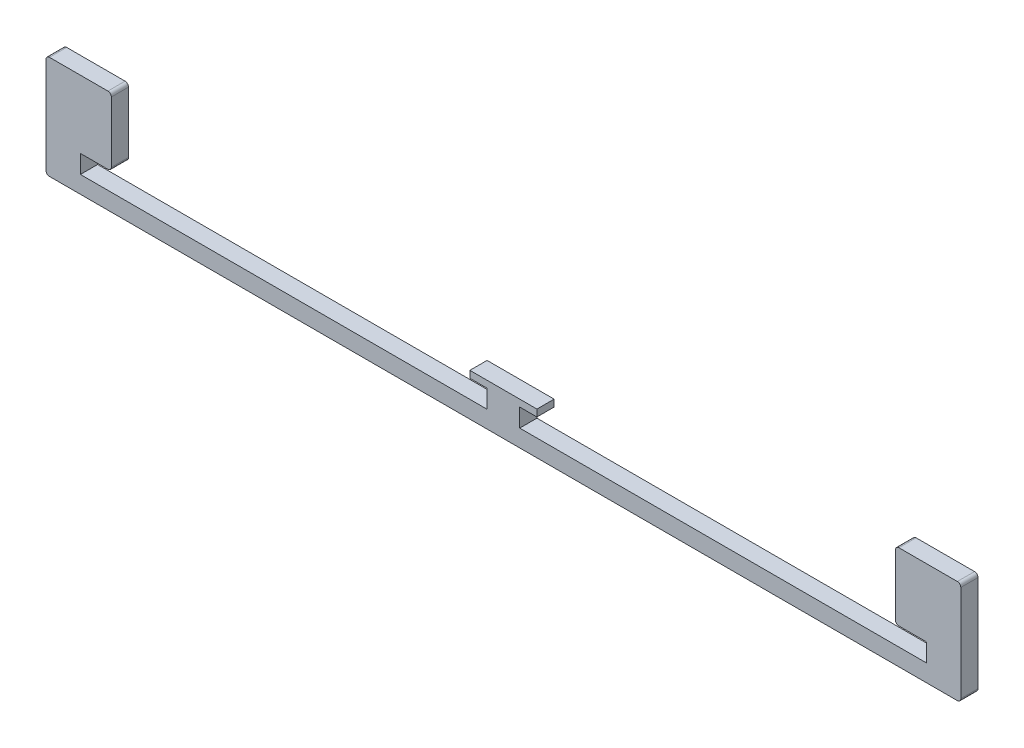
ISO-10303-21;
HEADER;
FILE_DESCRIPTION(('STEP AP214'),'2;1');
FILE_NAME('part.step','',(''),(''),'','','');
FILE_SCHEMA(('AUTOMOTIVE_DESIGN { 1 0 10303 214 1 1 1 1 }'));
ENDSEC;
DATA;
#1=APPLICATION_CONTEXT('core data for automotive mechanical design processes');
#2=APPLICATION_PROTOCOL_DEFINITION('international standard','automotive_design',2000,#1);
#3=PRODUCT_CONTEXT('',#1,'mechanical');
#4=PRODUCT('Part','Part','',(#3));
#5=PRODUCT_RELATED_PRODUCT_CATEGORY('part','',(#4));
#6=PRODUCT_DEFINITION_FORMATION('','',#4);
#7=PRODUCT_DEFINITION_CONTEXT('part definition',#1,'design');
#8=PRODUCT_DEFINITION('design','',#6,#7);
#9=PRODUCT_DEFINITION_SHAPE('','',#8);
#10=(LENGTH_UNIT() NAMED_UNIT(*) SI_UNIT(.MILLI.,.METRE.));
#11=(NAMED_UNIT(*) PLANE_ANGLE_UNIT() SI_UNIT($,.RADIAN.));
#12=(NAMED_UNIT(*) SI_UNIT($,.STERADIAN.) SOLID_ANGLE_UNIT());
#13=UNCERTAINTY_MEASURE_WITH_UNIT(LENGTH_MEASURE(1.E-05),#10,'distance_accuracy_value','');
#14=(GEOMETRIC_REPRESENTATION_CONTEXT(3) GLOBAL_UNCERTAINTY_ASSIGNED_CONTEXT((#13)) GLOBAL_UNIT_ASSIGNED_CONTEXT((#10,
#11,#12)) REPRESENTATION_CONTEXT('',''));
#15=CARTESIAN_POINT('',(0.,0.,0.));
#16=DIRECTION('',(0.,0.,1.));
#17=DIRECTION('',(1.,0.,0.));
#18=AXIS2_PLACEMENT_3D('',#15,#16,#17);
#19=CARTESIAN_POINT('',(0.,30.,5.));
#20=DIRECTION('',(1.,0.,0.));
#21=DIRECTION('',(0.,0.,-1.));
#22=AXIS2_PLACEMENT_3D('',#19,#20,#21);
#23=PLANE('',#22);
#24=DIRECTION('',(0.,-1.,0.));
#25=VECTOR('',#24,1.);
#26=CARTESIAN_POINT('',(0.,30.,0.));
#27=LINE('',#26,#25);
#28=CARTESIAN_POINT('',(0.,29.,0.));
#29=VERTEX_POINT('',#28);
#30=CARTESIAN_POINT('',(0.,1.,0.));
#31=VERTEX_POINT('',#30);
#32=EDGE_CURVE('E249',#29,#31,#27,.T.);
#33=ORIENTED_EDGE('',*,*,#32,.T.);
#34=DIRECTION('',(0.,0.,-1.));
#35=VECTOR('',#34,1.);
#36=CARTESIAN_POINT('',(0.,1.,5.));
#37=LINE('',#36,#35);
#38=CARTESIAN_POINT('',(0.,1.,5.));
#39=VERTEX_POINT('',#38);
#40=EDGE_CURVE('E374',#31,#39,#37,.F.);
#41=ORIENTED_EDGE('',*,*,#40,.T.);
#42=DIRECTION('',(0.,-1.,0.));
#43=VECTOR('',#42,1.);
#44=CARTESIAN_POINT('',(0.,30.,5.));
#45=LINE('',#44,#43);
#46=CARTESIAN_POINT('',(0.,29.,5.));
#47=VERTEX_POINT('',#46);
#48=EDGE_CURVE('E259',#47,#39,#45,.T.);
#49=ORIENTED_EDGE('',*,*,#48,.F.);
#50=DIRECTION('',(0.,0.,-1.));
#51=VECTOR('',#50,1.);
#52=CARTESIAN_POINT('',(0.,29.,5.));
#53=LINE('',#52,#51);
#54=EDGE_CURVE('E371',#47,#29,#53,.T.);
#55=ORIENTED_EDGE('',*,*,#54,.T.);
#56=EDGE_LOOP('',(#33,#41,#49,#55));
#57=FACE_BOUND('',#56,.T.);
#58=ADVANCED_FACE('F37',(#57),#23,.F.);
#59=CARTESIAN_POINT('',(0.,0.,5.));
#60=DIRECTION('',(0.,1.,0.));
#61=DIRECTION('',(0.,0.,1.));
#62=AXIS2_PLACEMENT_3D('',#59,#60,#61);
#63=PLANE('',#62);
#64=DIRECTION('',(1.,0.,0.));
#65=VECTOR('',#64,1.);
#66=CARTESIAN_POINT('',(0.,0.,0.));
#67=LINE('',#66,#65);
#68=CARTESIAN_POINT('',(1.,0.,0.));
#69=VERTEX_POINT('',#68);
#70=CARTESIAN_POINT('',(265.,0.,0.));
#71=VERTEX_POINT('',#70);
#72=EDGE_CURVE('E253',#69,#71,#67,.T.);
#73=ORIENTED_EDGE('',*,*,#72,.T.);
#74=DIRECTION('',(0.,0.,-1.));
#75=VECTOR('',#74,1.);
#76=CARTESIAN_POINT('',(265.,0.,5.));
#77=LINE('',#76,#75);
#78=CARTESIAN_POINT('',(265.,0.,5.));
#79=VERTEX_POINT('',#78);
#80=EDGE_CURVE('E341',#71,#79,#77,.F.);
#81=ORIENTED_EDGE('',*,*,#80,.T.);
#82=DIRECTION('',(1.,0.,0.));
#83=VECTOR('',#82,1.);
#84=CARTESIAN_POINT('',(0.,0.,5.));
#85=LINE('',#84,#83);
#86=CARTESIAN_POINT('',(1.,0.,5.));
#87=VERTEX_POINT('',#86);
#88=EDGE_CURVE('E232',#87,#79,#85,.T.);
#89=ORIENTED_EDGE('',*,*,#88,.F.);
#90=DIRECTION('',(0.,0.,-1.));
#91=VECTOR('',#90,1.);
#92=CARTESIAN_POINT('',(1.,0.,5.));
#93=LINE('',#92,#91);
#94=EDGE_CURVE('E338',#87,#69,#93,.T.);
#95=ORIENTED_EDGE('',*,*,#94,.T.);
#96=EDGE_LOOP('',(#73,#81,#89,#95));
#97=FACE_BOUND('',#96,.T.);
#98=ADVANCED_FACE('F412',(#97),#63,.F.);
#99=CARTESIAN_POINT('',(123.25,12.3,5.));
#100=DIRECTION('',(0.,-1.,0.));
#101=DIRECTION('',(0.,0.,-1.));
#102=AXIS2_PLACEMENT_3D('',#99,#100,#101);
#103=PLANE('',#102);
#104=DIRECTION('',(-1.,0.,0.));
#105=VECTOR('',#104,1.);
#106=CARTESIAN_POINT('',(123.25,12.3,0.));
#107=LINE('',#106,#105);
#108=CARTESIAN_POINT('',(142.75,12.3,0.));
#109=VERTEX_POINT('',#108);
#110=CARTESIAN_POINT('',(123.25,12.3,0.));
#111=VERTEX_POINT('',#110);
#112=EDGE_CURVE('E283',#109,#111,#107,.T.);
#113=ORIENTED_EDGE('',*,*,#112,.T.);
#114=DIRECTION('',(0.,0.,-1.));
#115=VECTOR('',#114,1.);
#116=CARTESIAN_POINT('',(123.25,12.3,5.));
#117=LINE('',#116,#115);
#118=CARTESIAN_POINT('',(123.25,12.3,5.));
#119=VERTEX_POINT('',#118);
#120=EDGE_CURVE('E229',#119,#111,#117,.T.);
#121=ORIENTED_EDGE('',*,*,#120,.F.);
#122=DIRECTION('',(-1.,0.,0.));
#123=VECTOR('',#122,1.);
#124=CARTESIAN_POINT('',(123.25,12.3,5.));
#125=LINE('',#124,#123);
#126=CARTESIAN_POINT('',(142.75,12.3,5.));
#127=VERTEX_POINT('',#126);
#128=EDGE_CURVE('E223',#127,#119,#125,.T.);
#129=ORIENTED_EDGE('',*,*,#128,.F.);
#130=DIRECTION('',(0.,0.,-1.));
#131=VECTOR('',#130,1.);
#132=CARTESIAN_POINT('',(142.75,12.3,5.));
#133=LINE('',#132,#131);
#134=EDGE_CURVE('E227',#127,#109,#133,.T.);
#135=ORIENTED_EDGE('',*,*,#134,.T.);
#136=EDGE_LOOP('',(#113,#121,#129,#135));
#137=FACE_BOUND('',#136,.T.);
#138=ADVANCED_FACE('F225',(#137),#103,.F.);
#139=CARTESIAN_POINT('',(123.25,10.3,5.));
#140=DIRECTION('',(1.,0.,0.));
#141=DIRECTION('',(0.,0.,-1.));
#142=AXIS2_PLACEMENT_3D('',#139,#140,#141);
#143=PLANE('',#142);
#144=DIRECTION('',(0.,-1.,0.));
#145=VECTOR('',#144,1.);
#146=CARTESIAN_POINT('',(123.25,10.3,0.));
#147=LINE('',#146,#145);
#148=CARTESIAN_POINT('',(123.25,10.3,0.));
#149=VERTEX_POINT('',#148);
#150=EDGE_CURVE('E285',#111,#149,#147,.T.);
#151=ORIENTED_EDGE('',*,*,#150,.T.);
#152=DIRECTION('',(0.,0.,-1.));
#153=VECTOR('',#152,1.);
#154=CARTESIAN_POINT('',(123.25,10.3,5.));
#155=LINE('',#154,#153);
#156=CARTESIAN_POINT('',(123.25,10.3,5.));
#157=VERTEX_POINT('',#156);
#158=EDGE_CURVE('E313',#157,#149,#155,.T.);
#159=ORIENTED_EDGE('',*,*,#158,.F.);
#160=DIRECTION('',(0.,-1.,0.));
#161=VECTOR('',#160,1.);
#162=CARTESIAN_POINT('',(123.25,10.3,5.));
#163=LINE('',#162,#161);
#164=EDGE_CURVE('E231',#119,#157,#163,.T.);
#165=ORIENTED_EDGE('',*,*,#164,.F.);
#166=ORIENTED_EDGE('',*,*,#120,.T.);
#167=EDGE_LOOP('',(#151,#159,#165,#166));
#168=FACE_BOUND('',#167,.T.);
#169=ADVANCED_FACE('F486',(#168),#143,.F.);
#170=CARTESIAN_POINT('',(123.25,10.3,5.));
#171=DIRECTION('',(0.,1.,0.));
#172=DIRECTION('',(0.,0.,1.));
#173=AXIS2_PLACEMENT_3D('',#170,#171,#172);
#174=PLANE('',#173);
#175=DIRECTION('',(1.,0.,0.));
#176=VECTOR('',#175,1.);
#177=CARTESIAN_POINT('',(123.25,10.3,0.));
#178=LINE('',#177,#176);
#179=CARTESIAN_POINT('',(128.25,10.3,0.));
#180=VERTEX_POINT('',#179);
#181=EDGE_CURVE('E287',#149,#180,#178,.T.);
#182=ORIENTED_EDGE('',*,*,#181,.T.);
#183=DIRECTION('',(0.,0.,-1.));
#184=VECTOR('',#183,1.);
#185=CARTESIAN_POINT('',(128.25,10.3,5.));
#186=LINE('',#185,#184);
#187=CARTESIAN_POINT('',(128.25,10.3,5.));
#188=VERTEX_POINT('',#187);
#189=EDGE_CURVE('E310',#188,#180,#186,.T.);
#190=ORIENTED_EDGE('',*,*,#189,.F.);
#191=DIRECTION('',(1.,0.,0.));
#192=VECTOR('',#191,1.);
#193=CARTESIAN_POINT('',(123.25,10.3,5.));
#194=LINE('',#193,#192);
#195=EDGE_CURVE('E265',#157,#188,#194,.T.);
#196=ORIENTED_EDGE('',*,*,#195,.F.);
#197=ORIENTED_EDGE('',*,*,#158,.T.);
#198=EDGE_LOOP('',(#182,#190,#196,#197));
#199=FACE_BOUND('',#198,.T.);
#200=ADVANCED_FACE('F493',(#199),#174,.F.);
#201=CARTESIAN_POINT('',(128.25,5.,5.));
#202=DIRECTION('',(1.,0.,0.));
#203=DIRECTION('',(0.,1.,0.));
#204=AXIS2_PLACEMENT_3D('',#201,#202,#203);
#205=PLANE('',#204);
#206=DIRECTION('',(0.,-1.,0.));
#207=VECTOR('',#206,1.);
#208=CARTESIAN_POINT('',(128.25,5.,0.));
#209=LINE('',#208,#207);
#210=CARTESIAN_POINT('',(128.25,5.,0.));
#211=VERTEX_POINT('',#210);
#212=EDGE_CURVE('E289',#180,#211,#209,.T.);
#213=ORIENTED_EDGE('',*,*,#212,.T.);
#214=DIRECTION('',(0.,0.,-1.));
#215=VECTOR('',#214,1.);
#216=CARTESIAN_POINT('',(128.25,5.,5.));
#217=LINE('',#216,#215);
#218=CARTESIAN_POINT('',(128.25,5.,5.));
#219=VERTEX_POINT('',#218);
#220=EDGE_CURVE('E307',#219,#211,#217,.T.);
#221=ORIENTED_EDGE('',*,*,#220,.F.);
#222=DIRECTION('',(0.,-1.,0.));
#223=VECTOR('',#222,1.);
#224=CARTESIAN_POINT('',(128.25,5.,5.));
#225=LINE('',#224,#223);
#226=EDGE_CURVE('E267',#188,#219,#225,.T.);
#227=ORIENTED_EDGE('',*,*,#226,.F.);
#228=ORIENTED_EDGE('',*,*,#189,.T.);
#229=EDGE_LOOP('',(#213,#221,#227,#228));
#230=FACE_BOUND('',#229,.T.);
#231=ADVANCED_FACE('F496',(#230),#205,.F.);
#232=CARTESIAN_POINT('',(10.,5.,5.));
#233=DIRECTION('',(0.,-1.,0.));
#234=DIRECTION('',(0.,0.,-1.));
#235=AXIS2_PLACEMENT_3D('',#232,#233,#234);
#236=PLANE('',#235);
#237=DIRECTION('',(-1.,0.,0.));
#238=VECTOR('',#237,1.);
#239=CARTESIAN_POINT('',(10.,5.,0.));
#240=LINE('',#239,#238);
#241=CARTESIAN_POINT('',(10.,5.,0.));
#242=VERTEX_POINT('',#241);
#243=EDGE_CURVE('E291',#211,#242,#240,.T.);
#244=ORIENTED_EDGE('',*,*,#243,.T.);
#245=DIRECTION('',(0.,0.,-1.));
#246=VECTOR('',#245,1.);
#247=CARTESIAN_POINT('',(10.,5.,5.));
#248=LINE('',#247,#246);
#249=CARTESIAN_POINT('',(10.,5.,5.));
#250=VERTEX_POINT('',#249);
#251=EDGE_CURVE('E304',#250,#242,#248,.T.);
#252=ORIENTED_EDGE('',*,*,#251,.F.);
#253=DIRECTION('',(-1.,0.,0.));
#254=VECTOR('',#253,1.);
#255=CARTESIAN_POINT('',(10.,5.,5.));
#256=LINE('',#255,#254);
#257=EDGE_CURVE('E269',#219,#250,#256,.T.);
#258=ORIENTED_EDGE('',*,*,#257,.F.);
#259=ORIENTED_EDGE('',*,*,#220,.T.);
#260=EDGE_LOOP('',(#244,#252,#258,#259));
#261=FACE_BOUND('',#260,.T.);
#262=ADVANCED_FACE('F501',(#261),#236,.F.);
#263=CARTESIAN_POINT('',(10.,5.,5.));
#264=DIRECTION('',(-1.,0.,0.));
#265=DIRECTION('',(0.,-1.,0.));
#266=AXIS2_PLACEMENT_3D('',#263,#264,#265);
#267=PLANE('',#266);
#268=DIRECTION('',(0.,1.,0.));
#269=VECTOR('',#268,1.);
#270=CARTESIAN_POINT('',(10.,5.,0.));
#271=LINE('',#270,#269);
#272=CARTESIAN_POINT('',(10.,10.3,0.));
#273=VERTEX_POINT('',#272);
#274=EDGE_CURVE('E293',#242,#273,#271,.T.);
#275=ORIENTED_EDGE('',*,*,#274,.T.);
#276=DIRECTION('',(0.,0.,-1.));
#277=VECTOR('',#276,1.);
#278=CARTESIAN_POINT('',(10.,10.3,5.));
#279=LINE('',#278,#277);
#280=CARTESIAN_POINT('',(10.,10.3,5.));
#281=VERTEX_POINT('',#280);
#282=EDGE_CURVE('E279',#281,#273,#279,.T.);
#283=ORIENTED_EDGE('',*,*,#282,.F.);
#284=DIRECTION('',(0.,1.,0.));
#285=VECTOR('',#284,1.);
#286=CARTESIAN_POINT('',(10.,5.,5.));
#287=LINE('',#286,#285);
#288=EDGE_CURVE('E271',#250,#281,#287,.T.);
#289=ORIENTED_EDGE('',*,*,#288,.F.);
#290=ORIENTED_EDGE('',*,*,#251,.T.);
#291=EDGE_LOOP('',(#275,#283,#289,#290));
#292=FACE_BOUND('',#291,.T.);
#293=ADVANCED_FACE('F506',(#292),#267,.F.);
#294=CARTESIAN_POINT('',(10.,10.3,5.));
#295=DIRECTION('',(0.,1.,0.));
#296=DIRECTION('',(0.,0.,1.));
#297=AXIS2_PLACEMENT_3D('',#294,#295,#296);
#298=PLANE('',#297);
#299=DIRECTION('',(1.,0.,0.));
#300=VECTOR('',#299,1.);
#301=CARTESIAN_POINT('',(10.,10.3,0.));
#302=LINE('',#301,#300);
#303=CARTESIAN_POINT('',(18.,10.3,0.));
#304=VERTEX_POINT('',#303);
#305=EDGE_CURVE('E295',#273,#304,#302,.T.);
#306=ORIENTED_EDGE('',*,*,#305,.T.);
#307=DIRECTION('',(0.,0.,-1.));
#308=VECTOR('',#307,1.);
#309=CARTESIAN_POINT('',(18.,10.3,5.));
#310=LINE('',#309,#308);
#311=CARTESIAN_POINT('',(18.,10.3,5.));
#312=VERTEX_POINT('',#311);
#313=EDGE_CURVE('E11',#304,#312,#310,.F.);
#314=ORIENTED_EDGE('',*,*,#313,.T.);
#315=DIRECTION('',(1.,0.,0.));
#316=VECTOR('',#315,1.);
#317=CARTESIAN_POINT('',(10.,10.3,5.));
#318=LINE('',#317,#316);
#319=EDGE_CURVE('E273',#281,#312,#318,.T.);
#320=ORIENTED_EDGE('',*,*,#319,.F.);
#321=ORIENTED_EDGE('',*,*,#282,.T.);
#322=EDGE_LOOP('',(#306,#314,#320,#321));
#323=FACE_BOUND('',#322,.T.);
#324=ADVANCED_FACE('F510',(#323),#298,.F.);
#325=CARTESIAN_POINT('',(19.,10.3,5.));
#326=DIRECTION('',(-1.,0.,0.));
#327=DIRECTION('',(0.,0.,1.));
#328=AXIS2_PLACEMENT_3D('',#325,#326,#327);
#329=PLANE('',#328);
#330=DIRECTION('',(0.,1.,0.));
#331=VECTOR('',#330,1.);
#332=CARTESIAN_POINT('',(19.,10.3,0.));
#333=LINE('',#332,#331);
#334=CARTESIAN_POINT('',(19.,11.3,0.));
#335=VERTEX_POINT('',#334);
#336=CARTESIAN_POINT('',(19.,29.,0.));
#337=VERTEX_POINT('',#336);
#338=EDGE_CURVE('E298',#335,#337,#333,.T.);
#339=ORIENTED_EDGE('',*,*,#338,.T.);
#340=DIRECTION('',(0.,0.,-1.));
#341=VECTOR('',#340,1.);
#342=CARTESIAN_POINT('',(19.,29.,5.));
#343=LINE('',#342,#341);
#344=CARTESIAN_POINT('',(19.,29.,5.));
#345=VERTEX_POINT('',#344);
#346=EDGE_CURVE('E45',#337,#345,#343,.F.);
#347=ORIENTED_EDGE('',*,*,#346,.T.);
#348=DIRECTION('',(0.,1.,0.));
#349=VECTOR('',#348,1.);
#350=CARTESIAN_POINT('',(19.,10.3,5.));
#351=LINE('',#350,#349);
#352=CARTESIAN_POINT('',(19.,11.3,5.));
#353=VERTEX_POINT('',#352);
#354=EDGE_CURVE('E276',#353,#345,#351,.T.);
#355=ORIENTED_EDGE('',*,*,#354,.F.);
#356=DIRECTION('',(0.,0.,-1.));
#357=VECTOR('',#356,1.);
#358=CARTESIAN_POINT('',(19.,11.3,5.));
#359=LINE('',#358,#357);
#360=EDGE_CURVE('E380',#353,#335,#359,.T.);
#361=ORIENTED_EDGE('',*,*,#360,.T.);
#362=EDGE_LOOP('',(#339,#347,#355,#361));
#363=FACE_BOUND('',#362,.T.);
#364=ADVANCED_FACE('F385',(#363),#329,.F.);
#365=CARTESIAN_POINT('',(0.,30.,5.));
#366=DIRECTION('',(0.,-1.,0.));
#367=DIRECTION('',(0.,0.,-1.));
#368=AXIS2_PLACEMENT_3D('',#365,#366,#367);
#369=PLANE('',#368);
#370=DIRECTION('',(-1.,0.,0.));
#371=VECTOR('',#370,1.);
#372=CARTESIAN_POINT('',(0.,30.,0.));
#373=LINE('',#372,#371);
#374=CARTESIAN_POINT('',(18.,30.,0.));
#375=VERTEX_POINT('',#374);
#376=CARTESIAN_POINT('',(1.,30.,0.));
#377=VERTEX_POINT('',#376);
#378=EDGE_CURVE('E262',#375,#377,#373,.T.);
#379=ORIENTED_EDGE('',*,*,#378,.T.);
#380=DIRECTION('',(0.,0.,-1.));
#381=VECTOR('',#380,1.);
#382=CARTESIAN_POINT('',(1.,30.,5.));
#383=LINE('',#382,#381);
#384=CARTESIAN_POINT('',(1.,30.,5.));
#385=VERTEX_POINT('',#384);
#386=EDGE_CURVE('E52',#377,#385,#383,.F.);
#387=ORIENTED_EDGE('',*,*,#386,.T.);
#388=DIRECTION('',(-1.,0.,0.));
#389=VECTOR('',#388,1.);
#390=CARTESIAN_POINT('',(0.,30.,5.));
#391=LINE('',#390,#389);
#392=CARTESIAN_POINT('',(18.,30.,5.));
#393=VERTEX_POINT('',#392);
#394=EDGE_CURVE('E278',#393,#385,#391,.T.);
#395=ORIENTED_EDGE('',*,*,#394,.F.);
#396=DIRECTION('',(0.,0.,-1.));
#397=VECTOR('',#396,1.);
#398=CARTESIAN_POINT('',(18.,30.,5.));
#399=LINE('',#398,#397);
#400=EDGE_CURVE('E376',#393,#375,#399,.T.);
#401=ORIENTED_EDGE('',*,*,#400,.T.);
#402=EDGE_LOOP('',(#379,#387,#395,#401));
#403=FACE_BOUND('',#402,.T.);
#404=ADVANCED_FACE('F393',(#403),#369,.F.);
#405=CARTESIAN_POINT('',(0.,0.,5.));
#406=DIRECTION('',(0.,0.,1.));
#407=DIRECTION('',(1.,0.,0.));
#408=AXIS2_PLACEMENT_3D('',#405,#406,#407);
#409=PLANE('',#408);
#410=ORIENTED_EDGE('',*,*,#88,.T.);
#411=CARTESIAN_POINT('',(265.,1.,5.));
#412=DIRECTION('',(0.,0.,1.));
#413=DIRECTION('',(1.,0.,0.));
#414=AXIS2_PLACEMENT_3D('',#411,#412,#413);
#415=CIRCLE('',#414,1.);
#416=CARTESIAN_POINT('',(266.,1.,5.));
#417=VERTEX_POINT('',#416);
#418=EDGE_CURVE('E356',#79,#417,#415,.T.);
#419=ORIENTED_EDGE('',*,*,#418,.T.);
#420=DIRECTION('',(0.,-1.,0.));
#421=VECTOR('',#420,1.);
#422=CARTESIAN_POINT('',(266.,30.,5.));
#423=LINE('',#422,#421);
#424=CARTESIAN_POINT('',(266.,29.,5.));
#425=VERTEX_POINT('',#424);
#426=EDGE_CURVE('E243',#425,#417,#423,.T.);
#427=ORIENTED_EDGE('',*,*,#426,.F.);
#428=CARTESIAN_POINT('',(265.,29.,5.));
#429=DIRECTION('',(0.,0.,1.));
#430=DIRECTION('',(1.,0.,0.));
#431=AXIS2_PLACEMENT_3D('',#428,#429,#430);
#432=CIRCLE('',#431,1.);
#433=CARTESIAN_POINT('',(265.,30.,5.));
#434=VERTEX_POINT('',#433);
#435=EDGE_CURVE('E354',#425,#434,#432,.T.);
#436=ORIENTED_EDGE('',*,*,#435,.T.);
#437=DIRECTION('',(1.,0.,0.));
#438=VECTOR('',#437,1.);
#439=CARTESIAN_POINT('',(266.,30.,5.));
#440=LINE('',#439,#438);
#441=CARTESIAN_POINT('',(248.,30.,5.));
#442=VERTEX_POINT('',#441);
#443=EDGE_CURVE('E448',#442,#434,#440,.T.);
#444=ORIENTED_EDGE('',*,*,#443,.F.);
#445=CARTESIAN_POINT('',(248.,29.,5.));
#446=DIRECTION('',(0.,0.,1.));
#447=DIRECTION('',(1.,0.,0.));
#448=AXIS2_PLACEMENT_3D('',#445,#446,#447);
#449=CIRCLE('',#448,1.);
#450=CARTESIAN_POINT('',(247.,29.,5.));
#451=VERTEX_POINT('',#450);
#452=EDGE_CURVE('E352',#442,#451,#449,.T.);
#453=ORIENTED_EDGE('',*,*,#452,.T.);
#454=DIRECTION('',(0.,1.,0.));
#455=VECTOR('',#454,1.);
#456=CARTESIAN_POINT('',(247.,10.3,5.));
#457=LINE('',#456,#455);
#458=CARTESIAN_POINT('',(247.,11.3,5.));
#459=VERTEX_POINT('',#458);
#460=EDGE_CURVE('E445',#459,#451,#457,.T.);
#461=ORIENTED_EDGE('',*,*,#460,.F.);
#462=CARTESIAN_POINT('',(248.,11.3,5.));
#463=DIRECTION('',(0.,0.,1.));
#464=DIRECTION('',(1.,0.,0.));
#465=AXIS2_PLACEMENT_3D('',#462,#463,#464);
#466=CIRCLE('',#465,1.);
#467=CARTESIAN_POINT('',(248.,10.3,5.));
#468=VERTEX_POINT('',#467);
#469=EDGE_CURVE('E350',#459,#468,#466,.T.);
#470=ORIENTED_EDGE('',*,*,#469,.T.);
#471=DIRECTION('',(-1.,0.,0.));
#472=VECTOR('',#471,1.);
#473=CARTESIAN_POINT('',(256.,10.3,5.));
#474=LINE('',#473,#472);
#475=CARTESIAN_POINT('',(256.,10.3,5.));
#476=VERTEX_POINT('',#475);
#477=EDGE_CURVE('E442',#476,#468,#474,.T.);
#478=ORIENTED_EDGE('',*,*,#477,.F.);
#479=DIRECTION('',(0.,1.,0.));
#480=VECTOR('',#479,1.);
#481=CARTESIAN_POINT('',(256.,5.,5.));
#482=LINE('',#481,#480);
#483=CARTESIAN_POINT('',(256.,5.,5.));
#484=VERTEX_POINT('',#483);
#485=EDGE_CURVE('E439',#484,#476,#482,.T.);
#486=ORIENTED_EDGE('',*,*,#485,.F.);
#487=DIRECTION('',(1.,0.,0.));
#488=VECTOR('',#487,1.);
#489=CARTESIAN_POINT('',(256.,5.,5.));
#490=LINE('',#489,#488);
#491=CARTESIAN_POINT('',(137.75,5.,5.));
#492=VERTEX_POINT('',#491);
#493=EDGE_CURVE('E436',#492,#484,#490,.T.);
#494=ORIENTED_EDGE('',*,*,#493,.F.);
#495=DIRECTION('',(0.,-1.,0.));
#496=VECTOR('',#495,1.);
#497=CARTESIAN_POINT('',(137.75,5.,5.));
#498=LINE('',#497,#496);
#499=CARTESIAN_POINT('',(137.75,10.3,5.));
#500=VERTEX_POINT('',#499);
#501=EDGE_CURVE('E433',#500,#492,#498,.T.);
#502=ORIENTED_EDGE('',*,*,#501,.F.);
#503=DIRECTION('',(-1.,0.,0.));
#504=VECTOR('',#503,1.);
#505=CARTESIAN_POINT('',(142.75,10.3,5.));
#506=LINE('',#505,#504);
#507=CARTESIAN_POINT('',(142.75,10.3,5.));
#508=VERTEX_POINT('',#507);
#509=EDGE_CURVE('E239',#508,#500,#506,.T.);
#510=ORIENTED_EDGE('',*,*,#509,.F.);
#511=DIRECTION('',(0.,-1.,0.));
#512=VECTOR('',#511,1.);
#513=CARTESIAN_POINT('',(142.75,10.3,5.));
#514=LINE('',#513,#512);
#515=EDGE_CURVE('E235',#127,#508,#514,.T.);
#516=ORIENTED_EDGE('',*,*,#515,.F.);
#517=ORIENTED_EDGE('',*,*,#128,.T.);
#518=ORIENTED_EDGE('',*,*,#164,.T.);
#519=ORIENTED_EDGE('',*,*,#195,.T.);
#520=ORIENTED_EDGE('',*,*,#226,.T.);
#521=ORIENTED_EDGE('',*,*,#257,.T.);
#522=ORIENTED_EDGE('',*,*,#288,.T.);
#523=ORIENTED_EDGE('',*,*,#319,.T.);
#524=CARTESIAN_POINT('',(18.,11.3,5.));
#525=DIRECTION('',(0.,0.,1.));
#526=DIRECTION('',(1.,0.,0.));
#527=AXIS2_PLACEMENT_3D('',#524,#525,#526);
#528=CIRCLE('',#527,1.);
#529=EDGE_CURVE('E343',#312,#353,#528,.T.);
#530=ORIENTED_EDGE('',*,*,#529,.T.);
#531=ORIENTED_EDGE('',*,*,#354,.T.);
#532=CARTESIAN_POINT('',(18.,29.,5.));
#533=DIRECTION('',(0.,0.,1.));
#534=DIRECTION('',(1.,0.,0.));
#535=AXIS2_PLACEMENT_3D('',#532,#533,#534);
#536=CIRCLE('',#535,1.);
#537=EDGE_CURVE('E59',#345,#393,#536,.T.);
#538=ORIENTED_EDGE('',*,*,#537,.T.);
#539=ORIENTED_EDGE('',*,*,#394,.T.);
#540=CARTESIAN_POINT('',(1.,29.,5.));
#541=DIRECTION('',(0.,0.,1.));
#542=DIRECTION('',(1.,0.,0.));
#543=AXIS2_PLACEMENT_3D('',#540,#541,#542);
#544=CIRCLE('',#543,1.);
#545=EDGE_CURVE('E346',#385,#47,#544,.T.);
#546=ORIENTED_EDGE('',*,*,#545,.T.);
#547=ORIENTED_EDGE('',*,*,#48,.T.);
#548=CARTESIAN_POINT('',(1.,1.,5.));
#549=DIRECTION('',(0.,0.,1.));
#550=DIRECTION('',(1.,0.,0.));
#551=AXIS2_PLACEMENT_3D('',#548,#549,#550);
#552=CIRCLE('',#551,1.);
#553=EDGE_CURVE('E348',#39,#87,#552,.T.);
#554=ORIENTED_EDGE('',*,*,#553,.T.);
#555=EDGE_LOOP('',(#410,#419,#427,#436,#444,#453,#461,#470,#478,#486,#494,#502,#510,#516,#517,
#518,#519,#520,#521,#522,#523,#530,#531,#538,#539,#546,#547,#554));
#556=FACE_BOUND('',#555,.T.);
#557=ADVANCED_FACE('F237',(#556),#409,.T.);
#558=CARTESIAN_POINT('',(0.,0.,0.));
#559=DIRECTION('',(0.,0.,1.));
#560=DIRECTION('',(1.,0.,0.));
#561=AXIS2_PLACEMENT_3D('',#558,#559,#560);
#562=PLANE('',#561);
#563=DIRECTION('',(0.,-1.,0.));
#564=VECTOR('',#563,1.);
#565=CARTESIAN_POINT('',(266.,30.,0.));
#566=LINE('',#565,#564);
#567=CARTESIAN_POINT('',(266.,29.,0.));
#568=VERTEX_POINT('',#567);
#569=CARTESIAN_POINT('',(266.,1.,0.));
#570=VERTEX_POINT('',#569);
#571=EDGE_CURVE('E415',#568,#570,#566,.T.);
#572=ORIENTED_EDGE('',*,*,#571,.T.);
#573=CARTESIAN_POINT('',(265.,1.,0.));
#574=DIRECTION('',(0.,0.,1.));
#575=DIRECTION('',(1.,0.,0.));
#576=AXIS2_PLACEMENT_3D('',#573,#574,#575);
#577=CIRCLE('',#576,1.);
#578=EDGE_CURVE('E336',#570,#71,#577,.F.);
#579=ORIENTED_EDGE('',*,*,#578,.T.);
#580=ORIENTED_EDGE('',*,*,#72,.F.);
#581=CARTESIAN_POINT('',(1.,1.,0.));
#582=DIRECTION('',(0.,0.,1.));
#583=DIRECTION('',(1.,0.,0.));
#584=AXIS2_PLACEMENT_3D('',#581,#582,#583);
#585=CIRCLE('',#584,1.);
#586=EDGE_CURVE('E328',#69,#31,#585,.F.);
#587=ORIENTED_EDGE('',*,*,#586,.T.);
#588=ORIENTED_EDGE('',*,*,#32,.F.);
#589=CARTESIAN_POINT('',(1.,29.,0.));
#590=DIRECTION('',(0.,0.,1.));
#591=DIRECTION('',(1.,0.,0.));
#592=AXIS2_PLACEMENT_3D('',#589,#590,#591);
#593=CIRCLE('',#592,1.);
#594=EDGE_CURVE('E326',#29,#377,#593,.F.);
#595=ORIENTED_EDGE('',*,*,#594,.T.);
#596=ORIENTED_EDGE('',*,*,#378,.F.);
#597=CARTESIAN_POINT('',(18.,29.,0.));
#598=DIRECTION('',(0.,0.,1.));
#599=DIRECTION('',(1.,0.,0.));
#600=AXIS2_PLACEMENT_3D('',#597,#598,#599);
#601=CIRCLE('',#600,1.);
#602=EDGE_CURVE('E324',#375,#337,#601,.F.);
#603=ORIENTED_EDGE('',*,*,#602,.T.);
#604=ORIENTED_EDGE('',*,*,#338,.F.);
#605=CARTESIAN_POINT('',(18.,11.3,0.));
#606=DIRECTION('',(0.,0.,1.));
#607=DIRECTION('',(1.,0.,0.));
#608=AXIS2_PLACEMENT_3D('',#605,#606,#607);
#609=CIRCLE('',#608,1.);
#610=EDGE_CURVE('E322',#335,#304,#609,.F.);
#611=ORIENTED_EDGE('',*,*,#610,.T.);
#612=ORIENTED_EDGE('',*,*,#305,.F.);
#613=ORIENTED_EDGE('',*,*,#274,.F.);
#614=ORIENTED_EDGE('',*,*,#243,.F.);
#615=ORIENTED_EDGE('',*,*,#212,.F.);
#616=ORIENTED_EDGE('',*,*,#181,.F.);
#617=ORIENTED_EDGE('',*,*,#150,.F.);
#618=ORIENTED_EDGE('',*,*,#112,.F.);
#619=DIRECTION('',(0.,-1.,0.));
#620=VECTOR('',#619,1.);
#621=CARTESIAN_POINT('',(142.75,10.3,0.));
#622=LINE('',#621,#620);
#623=CARTESIAN_POINT('',(142.75,10.3,0.));
#624=VERTEX_POINT('',#623);
#625=EDGE_CURVE('E248',#109,#624,#622,.T.);
#626=ORIENTED_EDGE('',*,*,#625,.T.);
#627=DIRECTION('',(-1.,0.,0.));
#628=VECTOR('',#627,1.);
#629=CARTESIAN_POINT('',(142.75,10.3,0.));
#630=LINE('',#629,#628);
#631=CARTESIAN_POINT('',(137.75,10.3,0.));
#632=VERTEX_POINT('',#631);
#633=EDGE_CURVE('E454',#624,#632,#630,.T.);
#634=ORIENTED_EDGE('',*,*,#633,.T.);
#635=DIRECTION('',(0.,-1.,0.));
#636=VECTOR('',#635,1.);
#637=CARTESIAN_POINT('',(137.75,5.,0.));
#638=LINE('',#637,#636);
#639=CARTESIAN_POINT('',(137.75,5.,0.));
#640=VERTEX_POINT('',#639);
#641=EDGE_CURVE('E457',#632,#640,#638,.T.);
#642=ORIENTED_EDGE('',*,*,#641,.T.);
#643=DIRECTION('',(1.,0.,0.));
#644=VECTOR('',#643,1.);
#645=CARTESIAN_POINT('',(256.,5.,0.));
#646=LINE('',#645,#644);
#647=CARTESIAN_POINT('',(256.,5.,0.));
#648=VERTEX_POINT('',#647);
#649=EDGE_CURVE('E460',#640,#648,#646,.T.);
#650=ORIENTED_EDGE('',*,*,#649,.T.);
#651=DIRECTION('',(0.,1.,0.));
#652=VECTOR('',#651,1.);
#653=CARTESIAN_POINT('',(256.,5.,0.));
#654=LINE('',#653,#652);
#655=CARTESIAN_POINT('',(256.,10.3,0.));
#656=VERTEX_POINT('',#655);
#657=EDGE_CURVE('E463',#648,#656,#654,.T.);
#658=ORIENTED_EDGE('',*,*,#657,.T.);
#659=DIRECTION('',(-1.,0.,0.));
#660=VECTOR('',#659,1.);
#661=CARTESIAN_POINT('',(256.,10.3,0.));
#662=LINE('',#661,#660);
#663=CARTESIAN_POINT('',(248.,10.3,0.));
#664=VERTEX_POINT('',#663);
#665=EDGE_CURVE('E466',#656,#664,#662,.T.);
#666=ORIENTED_EDGE('',*,*,#665,.T.);
#667=CARTESIAN_POINT('',(248.,11.3,0.));
#668=DIRECTION('',(0.,0.,1.));
#669=DIRECTION('',(1.,0.,0.));
#670=AXIS2_PLACEMENT_3D('',#667,#668,#669);
#671=CIRCLE('',#670,1.);
#672=CARTESIAN_POINT('',(247.,11.3,0.));
#673=VERTEX_POINT('',#672);
#674=EDGE_CURVE('E330',#664,#673,#671,.F.);
#675=ORIENTED_EDGE('',*,*,#674,.T.);
#676=DIRECTION('',(0.,1.,0.));
#677=VECTOR('',#676,1.);
#678=CARTESIAN_POINT('',(247.,10.3,0.));
#679=LINE('',#678,#677);
#680=CARTESIAN_POINT('',(247.,29.,0.));
#681=VERTEX_POINT('',#680);
#682=EDGE_CURVE('E429',#673,#681,#679,.T.);
#683=ORIENTED_EDGE('',*,*,#682,.T.);
#684=CARTESIAN_POINT('',(248.,29.,0.));
#685=DIRECTION('',(0.,0.,1.));
#686=DIRECTION('',(1.,0.,0.));
#687=AXIS2_PLACEMENT_3D('',#684,#685,#686);
#688=CIRCLE('',#687,1.);
#689=CARTESIAN_POINT('',(248.,30.,0.));
#690=VERTEX_POINT('',#689);
#691=EDGE_CURVE('E332',#681,#690,#688,.F.);
#692=ORIENTED_EDGE('',*,*,#691,.T.);
#693=DIRECTION('',(1.,0.,0.));
#694=VECTOR('',#693,1.);
#695=CARTESIAN_POINT('',(266.,30.,0.));
#696=LINE('',#695,#694);
#697=CARTESIAN_POINT('',(265.,30.,0.));
#698=VERTEX_POINT('',#697);
#699=EDGE_CURVE('E426',#690,#698,#696,.T.);
#700=ORIENTED_EDGE('',*,*,#699,.T.);
#701=CARTESIAN_POINT('',(265.,29.,0.));
#702=DIRECTION('',(0.,0.,1.));
#703=DIRECTION('',(1.,0.,0.));
#704=AXIS2_PLACEMENT_3D('',#701,#702,#703);
#705=CIRCLE('',#704,1.);
#706=EDGE_CURVE('E334',#698,#568,#705,.F.);
#707=ORIENTED_EDGE('',*,*,#706,.T.);
#708=EDGE_LOOP('',(#572,#579,#580,#587,#588,#595,#596,#603,#604,#611,#612,#613,#614,#615,#616,
#617,#618,#626,#634,#642,#650,#658,#666,#675,#683,#692,#700,#707));
#709=FACE_BOUND('',#708,.T.);
#710=ADVANCED_FACE('F396',(#709),#562,.F.);
#711=CARTESIAN_POINT('',(266.,30.,5.));
#712=DIRECTION('',(-1.,0.,0.));
#713=DIRECTION('',(0.,0.,-1.));
#714=AXIS2_PLACEMENT_3D('',#711,#712,#713);
#715=PLANE('',#714);
#716=ORIENTED_EDGE('',*,*,#426,.T.);
#717=DIRECTION('',(0.,0.,-1.));
#718=VECTOR('',#717,1.);
#719=CARTESIAN_POINT('',(266.,1.,5.));
#720=LINE('',#719,#718);
#721=EDGE_CURVE('E319',#417,#570,#720,.T.);
#722=ORIENTED_EDGE('',*,*,#721,.T.);
#723=ORIENTED_EDGE('',*,*,#571,.F.);
#724=DIRECTION('',(0.,0.,-1.));
#725=VECTOR('',#724,1.);
#726=CARTESIAN_POINT('',(266.,29.,5.));
#727=LINE('',#726,#725);
#728=EDGE_CURVE('E317',#568,#425,#727,.F.);
#729=ORIENTED_EDGE('',*,*,#728,.T.);
#730=EDGE_LOOP('',(#716,#722,#723,#729));
#731=FACE_BOUND('',#730,.T.);
#732=ADVANCED_FACE('F422',(#731),#715,.F.);
#733=CARTESIAN_POINT('',(142.75,10.3,5.));
#734=DIRECTION('',(-1.,0.,0.));
#735=DIRECTION('',(0.,0.,-1.));
#736=AXIS2_PLACEMENT_3D('',#733,#734,#735);
#737=PLANE('',#736);
#738=ORIENTED_EDGE('',*,*,#625,.F.);
#739=ORIENTED_EDGE('',*,*,#134,.F.);
#740=ORIENTED_EDGE('',*,*,#515,.T.);
#741=DIRECTION('',(0.,0.,-1.));
#742=VECTOR('',#741,1.);
#743=CARTESIAN_POINT('',(142.75,10.3,5.));
#744=LINE('',#743,#742);
#745=EDGE_CURVE('E250',#508,#624,#744,.T.);
#746=ORIENTED_EDGE('',*,*,#745,.T.);
#747=EDGE_LOOP('',(#738,#739,#740,#746));
#748=FACE_BOUND('',#747,.T.);
#749=ADVANCED_FACE('F246',(#748),#737,.F.);
#750=CARTESIAN_POINT('',(142.75,10.3,5.));
#751=DIRECTION('',(0.,1.,0.));
#752=DIRECTION('',(0.,0.,1.));
#753=AXIS2_PLACEMENT_3D('',#750,#751,#752);
#754=PLANE('',#753);
#755=ORIENTED_EDGE('',*,*,#633,.F.);
#756=ORIENTED_EDGE('',*,*,#745,.F.);
#757=ORIENTED_EDGE('',*,*,#509,.T.);
#758=DIRECTION('',(0.,0.,-1.));
#759=VECTOR('',#758,1.);
#760=CARTESIAN_POINT('',(137.75,10.3,5.));
#761=LINE('',#760,#759);
#762=EDGE_CURVE('E255',#500,#632,#761,.T.);
#763=ORIENTED_EDGE('',*,*,#762,.T.);
#764=EDGE_LOOP('',(#755,#756,#757,#763));
#765=FACE_BOUND('',#764,.T.);
#766=ADVANCED_FACE('F481',(#765),#754,.F.);
#767=CARTESIAN_POINT('',(137.75,5.,5.));
#768=DIRECTION('',(-1.,0.,0.));
#769=DIRECTION('',(0.,1.,0.));
#770=AXIS2_PLACEMENT_3D('',#767,#768,#769);
#771=PLANE('',#770);
#772=ORIENTED_EDGE('',*,*,#641,.F.);
#773=ORIENTED_EDGE('',*,*,#762,.F.);
#774=ORIENTED_EDGE('',*,*,#501,.T.);
#775=DIRECTION('',(0.,0.,-1.));
#776=VECTOR('',#775,1.);
#777=CARTESIAN_POINT('',(137.75,5.,5.));
#778=LINE('',#777,#776);
#779=EDGE_CURVE('E476',#492,#640,#778,.T.);
#780=ORIENTED_EDGE('',*,*,#779,.T.);
#781=EDGE_LOOP('',(#772,#773,#774,#780));
#782=FACE_BOUND('',#781,.T.);
#783=ADVANCED_FACE('F628',(#782),#771,.F.);
#784=CARTESIAN_POINT('',(256.,5.,5.));
#785=DIRECTION('',(0.,-1.,0.));
#786=DIRECTION('',(0.,0.,-1.));
#787=AXIS2_PLACEMENT_3D('',#784,#785,#786);
#788=PLANE('',#787);
#789=ORIENTED_EDGE('',*,*,#649,.F.);
#790=ORIENTED_EDGE('',*,*,#779,.F.);
#791=ORIENTED_EDGE('',*,*,#493,.T.);
#792=DIRECTION('',(0.,0.,-1.));
#793=VECTOR('',#792,1.);
#794=CARTESIAN_POINT('',(256.,5.,5.));
#795=LINE('',#794,#793);
#796=EDGE_CURVE('E473',#484,#648,#795,.T.);
#797=ORIENTED_EDGE('',*,*,#796,.T.);
#798=EDGE_LOOP('',(#789,#790,#791,#797));
#799=FACE_BOUND('',#798,.T.);
#800=ADVANCED_FACE('F619',(#799),#788,.F.);
#801=CARTESIAN_POINT('',(256.,5.,5.));
#802=DIRECTION('',(1.,0.,0.));
#803=DIRECTION('',(0.,-1.,0.));
#804=AXIS2_PLACEMENT_3D('',#801,#802,#803);
#805=PLANE('',#804);
#806=ORIENTED_EDGE('',*,*,#657,.F.);
#807=ORIENTED_EDGE('',*,*,#796,.F.);
#808=ORIENTED_EDGE('',*,*,#485,.T.);
#809=DIRECTION('',(0.,0.,-1.));
#810=VECTOR('',#809,1.);
#811=CARTESIAN_POINT('',(256.,10.3,5.));
#812=LINE('',#811,#810);
#813=EDGE_CURVE('E451',#476,#656,#812,.T.);
#814=ORIENTED_EDGE('',*,*,#813,.T.);
#815=EDGE_LOOP('',(#806,#807,#808,#814));
#816=FACE_BOUND('',#815,.T.);
#817=ADVANCED_FACE('F609',(#816),#805,.F.);
#818=CARTESIAN_POINT('',(256.,10.3,5.));
#819=DIRECTION('',(0.,1.,0.));
#820=DIRECTION('',(0.,0.,1.));
#821=AXIS2_PLACEMENT_3D('',#818,#819,#820);
#822=PLANE('',#821);
#823=ORIENTED_EDGE('',*,*,#477,.T.);
#824=DIRECTION('',(0.,0.,-1.));
#825=VECTOR('',#824,1.);
#826=CARTESIAN_POINT('',(248.,10.3,5.));
#827=LINE('',#826,#825);
#828=EDGE_CURVE('E368',#468,#664,#827,.T.);
#829=ORIENTED_EDGE('',*,*,#828,.T.);
#830=ORIENTED_EDGE('',*,*,#665,.F.);
#831=ORIENTED_EDGE('',*,*,#813,.F.);
#832=EDGE_LOOP('',(#823,#829,#830,#831));
#833=FACE_BOUND('',#832,.T.);
#834=ADVANCED_FACE('F600',(#833),#822,.F.);
#835=CARTESIAN_POINT('',(247.,10.3,5.));
#836=DIRECTION('',(1.,0.,0.));
#837=DIRECTION('',(0.,0.,1.));
#838=AXIS2_PLACEMENT_3D('',#835,#836,#837);
#839=PLANE('',#838);
#840=ORIENTED_EDGE('',*,*,#460,.T.);
#841=DIRECTION('',(0.,0.,-1.));
#842=VECTOR('',#841,1.);
#843=CARTESIAN_POINT('',(247.,29.,5.));
#844=LINE('',#843,#842);
#845=EDGE_CURVE('E365',#451,#681,#844,.T.);
#846=ORIENTED_EDGE('',*,*,#845,.T.);
#847=ORIENTED_EDGE('',*,*,#682,.F.);
#848=DIRECTION('',(0.,0.,-1.));
#849=VECTOR('',#848,1.);
#850=CARTESIAN_POINT('',(247.,11.3,5.));
#851=LINE('',#850,#849);
#852=EDGE_CURVE('E363',#673,#459,#851,.F.);
#853=ORIENTED_EDGE('',*,*,#852,.T.);
#854=EDGE_LOOP('',(#840,#846,#847,#853));
#855=FACE_BOUND('',#854,.T.);
#856=ADVANCED_FACE('F591',(#855),#839,.F.);
#857=CARTESIAN_POINT('',(266.,30.,5.));
#858=DIRECTION('',(0.,-1.,0.));
#859=DIRECTION('',(0.,0.,-1.));
#860=AXIS2_PLACEMENT_3D('',#857,#858,#859);
#861=PLANE('',#860);
#862=ORIENTED_EDGE('',*,*,#443,.T.);
#863=DIRECTION('',(0.,0.,-1.));
#864=VECTOR('',#863,1.);
#865=CARTESIAN_POINT('',(265.,30.,5.));
#866=LINE('',#865,#864);
#867=EDGE_CURVE('E360',#434,#698,#866,.T.);
#868=ORIENTED_EDGE('',*,*,#867,.T.);
#869=ORIENTED_EDGE('',*,*,#699,.F.);
#870=DIRECTION('',(0.,0.,-1.));
#871=VECTOR('',#870,1.);
#872=CARTESIAN_POINT('',(248.,30.,5.));
#873=LINE('',#872,#871);
#874=EDGE_CURVE('E358',#690,#442,#873,.F.);
#875=ORIENTED_EDGE('',*,*,#874,.T.);
#876=EDGE_LOOP('',(#862,#868,#869,#875));
#877=FACE_BOUND('',#876,.T.);
#878=ADVANCED_FACE('F528',(#877),#861,.F.);
#879=CARTESIAN_POINT('',(265.,1.,5.));
#880=DIRECTION('',(0.,0.,-1.));
#881=DIRECTION('',(-1.,0.,0.));
#882=AXIS2_PLACEMENT_3D('',#879,#880,#881);
#883=CYLINDRICAL_SURFACE('',#882,1.);
#884=ORIENTED_EDGE('',*,*,#418,.F.);
#885=ORIENTED_EDGE('',*,*,#80,.F.);
#886=ORIENTED_EDGE('',*,*,#578,.F.);
#887=ORIENTED_EDGE('',*,*,#721,.F.);
#888=EDGE_LOOP('',(#884,#885,#886,#887));
#889=FACE_BOUND('',#888,.T.);
#890=ADVANCED_FACE('F419',(#889),#883,.T.);
#891=CARTESIAN_POINT('',(265.,29.,5.));
#892=DIRECTION('',(0.,0.,-1.));
#893=DIRECTION('',(-1.,0.,0.));
#894=AXIS2_PLACEMENT_3D('',#891,#892,#893);
#895=CYLINDRICAL_SURFACE('',#894,1.);
#896=ORIENTED_EDGE('',*,*,#435,.F.);
#897=ORIENTED_EDGE('',*,*,#728,.F.);
#898=ORIENTED_EDGE('',*,*,#706,.F.);
#899=ORIENTED_EDGE('',*,*,#867,.F.);
#900=EDGE_LOOP('',(#896,#897,#898,#899));
#901=FACE_BOUND('',#900,.T.);
#902=ADVANCED_FACE('F527',(#901),#895,.T.);
#903=CARTESIAN_POINT('',(248.,29.,5.));
#904=DIRECTION('',(0.,0.,-1.));
#905=DIRECTION('',(-1.,0.,0.));
#906=AXIS2_PLACEMENT_3D('',#903,#904,#905);
#907=CYLINDRICAL_SURFACE('',#906,1.);
#908=ORIENTED_EDGE('',*,*,#452,.F.);
#909=ORIENTED_EDGE('',*,*,#874,.F.);
#910=ORIENTED_EDGE('',*,*,#691,.F.);
#911=ORIENTED_EDGE('',*,*,#845,.F.);
#912=EDGE_LOOP('',(#908,#909,#910,#911));
#913=FACE_BOUND('',#912,.T.);
#914=ADVANCED_FACE('F531',(#913),#907,.T.);
#915=CARTESIAN_POINT('',(248.,11.3,5.));
#916=DIRECTION('',(0.,0.,-1.));
#917=DIRECTION('',(-1.,0.,0.));
#918=AXIS2_PLACEMENT_3D('',#915,#916,#917);
#919=CYLINDRICAL_SURFACE('',#918,1.);
#920=ORIENTED_EDGE('',*,*,#469,.F.);
#921=ORIENTED_EDGE('',*,*,#852,.F.);
#922=ORIENTED_EDGE('',*,*,#674,.F.);
#923=ORIENTED_EDGE('',*,*,#828,.F.);
#924=EDGE_LOOP('',(#920,#921,#922,#923));
#925=FACE_BOUND('',#924,.T.);
#926=ADVANCED_FACE('F535',(#925),#919,.T.);
#927=CARTESIAN_POINT('',(1.,1.,5.));
#928=DIRECTION('',(0.,0.,-1.));
#929=DIRECTION('',(-1.,0.,0.));
#930=AXIS2_PLACEMENT_3D('',#927,#928,#929);
#931=CYLINDRICAL_SURFACE('',#930,1.);
#932=ORIENTED_EDGE('',*,*,#553,.F.);
#933=ORIENTED_EDGE('',*,*,#40,.F.);
#934=ORIENTED_EDGE('',*,*,#586,.F.);
#935=ORIENTED_EDGE('',*,*,#94,.F.);
#936=EDGE_LOOP('',(#932,#933,#934,#935));
#937=FACE_BOUND('',#936,.T.);
#938=ADVANCED_FACE('F409',(#937),#931,.T.);
#939=CARTESIAN_POINT('',(1.,29.,5.));
#940=DIRECTION('',(0.,0.,-1.));
#941=DIRECTION('',(-1.,0.,0.));
#942=AXIS2_PLACEMENT_3D('',#939,#940,#941);
#943=CYLINDRICAL_SURFACE('',#942,1.);
#944=ORIENTED_EDGE('',*,*,#545,.F.);
#945=ORIENTED_EDGE('',*,*,#386,.F.);
#946=ORIENTED_EDGE('',*,*,#594,.F.);
#947=ORIENTED_EDGE('',*,*,#54,.F.);
#948=EDGE_LOOP('',(#944,#945,#946,#947));
#949=FACE_BOUND('',#948,.T.);
#950=ADVANCED_FACE('F401',(#949),#943,.T.);
#951=CARTESIAN_POINT('',(18.,29.,5.));
#952=DIRECTION('',(0.,0.,-1.));
#953=DIRECTION('',(-1.,0.,0.));
#954=AXIS2_PLACEMENT_3D('',#951,#952,#953);
#955=CYLINDRICAL_SURFACE('',#954,1.);
#956=ORIENTED_EDGE('',*,*,#537,.F.);
#957=ORIENTED_EDGE('',*,*,#346,.F.);
#958=ORIENTED_EDGE('',*,*,#602,.F.);
#959=ORIENTED_EDGE('',*,*,#400,.F.);
#960=EDGE_LOOP('',(#956,#957,#958,#959));
#961=FACE_BOUND('',#960,.T.);
#962=ADVANCED_FACE('F391',(#961),#955,.T.);
#963=CARTESIAN_POINT('',(18.,11.3,5.));
#964=DIRECTION('',(0.,0.,-1.));
#965=DIRECTION('',(-1.,0.,0.));
#966=AXIS2_PLACEMENT_3D('',#963,#964,#965);
#967=CYLINDRICAL_SURFACE('',#966,1.);
#968=ORIENTED_EDGE('',*,*,#529,.F.);
#969=ORIENTED_EDGE('',*,*,#313,.F.);
#970=ORIENTED_EDGE('',*,*,#610,.F.);
#971=ORIENTED_EDGE('',*,*,#360,.F.);
#972=EDGE_LOOP('',(#968,#969,#970,#971));
#973=FACE_BOUND('',#972,.T.);
#974=ADVANCED_FACE('F39',(#973),#967,.T.);
#975=CLOSED_SHELL('',(#58,#98,#138,#169,#200,#231,#262,#293,#324,#364,#404,#557,#710,#732,#749,
#766,#783,#800,#817,#834,#856,#878,#890,#902,#914,#926,#938,#950,#962,#974));
#976=MANIFOLD_SOLID_BREP('B2',#975);
#977=ADVANCED_BREP_SHAPE_REPRESENTATION('',(#18,#976),#14);
#978=SHAPE_DEFINITION_REPRESENTATION(#9,#977);
ENDSEC;
END-ISO-10303-21;
